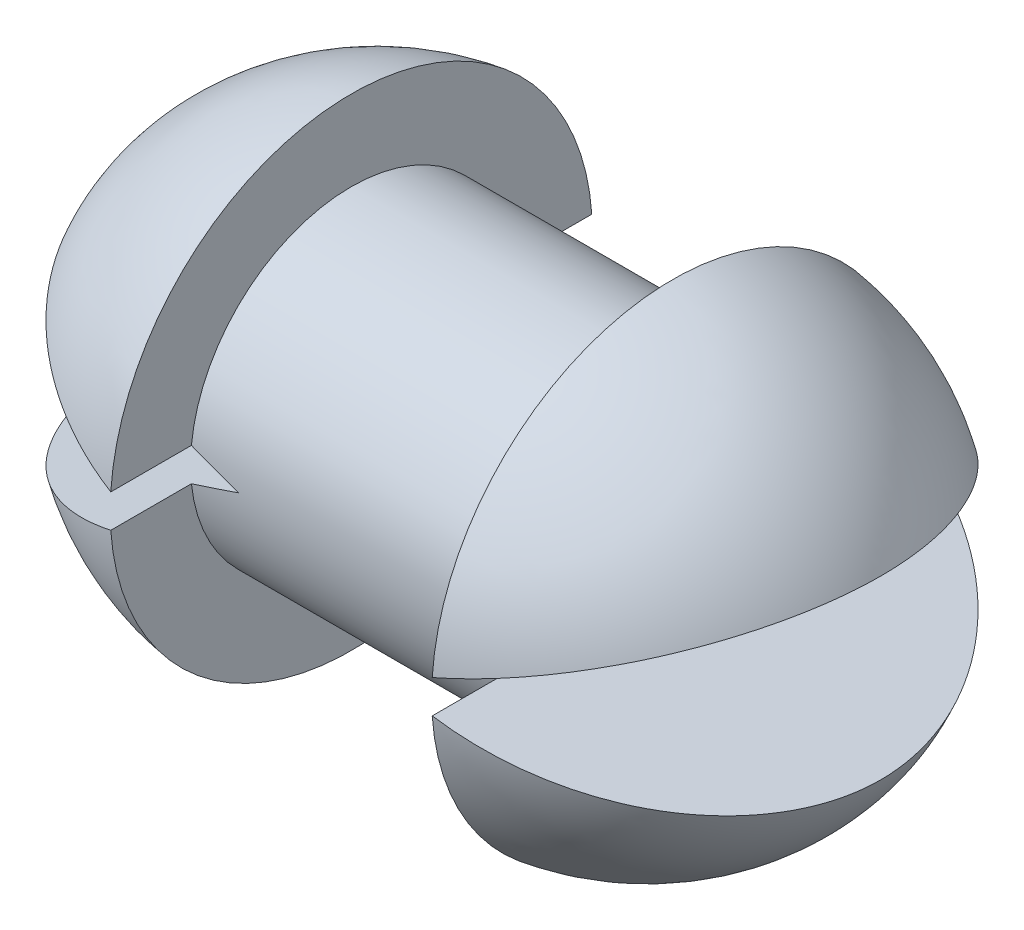
ISO-10303-21;
HEADER;
FILE_DESCRIPTION(('STEP AP214'),'2;1');
FILE_NAME('part.step','',(''),(''),'','','');
FILE_SCHEMA(('AUTOMOTIVE_DESIGN { 1 0 10303 214 1 1 1 1 }'));
ENDSEC;
DATA;
#1=APPLICATION_CONTEXT('core data for automotive mechanical design processes');
#2=APPLICATION_PROTOCOL_DEFINITION('international standard','automotive_design',2000,#1);
#3=PRODUCT_CONTEXT('',#1,'mechanical');
#4=PRODUCT('Part','Part','',(#3));
#5=PRODUCT_RELATED_PRODUCT_CATEGORY('part','',(#4));
#6=PRODUCT_DEFINITION_FORMATION('','',#4);
#7=PRODUCT_DEFINITION_CONTEXT('part definition',#1,'design');
#8=PRODUCT_DEFINITION('design','',#6,#7);
#9=PRODUCT_DEFINITION_SHAPE('','',#8);
#10=(LENGTH_UNIT() NAMED_UNIT(*) SI_UNIT(.MILLI.,.METRE.));
#11=(NAMED_UNIT(*) PLANE_ANGLE_UNIT() SI_UNIT($,.RADIAN.));
#12=(NAMED_UNIT(*) SI_UNIT($,.STERADIAN.) SOLID_ANGLE_UNIT());
#13=UNCERTAINTY_MEASURE_WITH_UNIT(LENGTH_MEASURE(1.E-05),#10,'distance_accuracy_value','');
#14=(GEOMETRIC_REPRESENTATION_CONTEXT(3) GLOBAL_UNCERTAINTY_ASSIGNED_CONTEXT((#13)) GLOBAL_UNIT_ASSIGNED_CONTEXT((#10,
#11,#12)) REPRESENTATION_CONTEXT('',''));
#15=CARTESIAN_POINT('',(0.,0.,0.));
#16=DIRECTION('',(0.,0.,1.));
#17=DIRECTION('',(1.,0.,0.));
#18=AXIS2_PLACEMENT_3D('',#15,#16,#17);
#19=CARTESIAN_POINT('',(-10.,0.,0.));
#20=DIRECTION('',(-1.,0.,0.));
#21=DIRECTION('',(0.,0.,1.));
#22=AXIS2_PLACEMENT_3D('',#19,#20,#21);
#23=PLANE('',#22);
#24=DIRECTION('',(0.,0.,-1.));
#25=VECTOR('',#24,1.);
#26=CARTESIAN_POINT('',(-10.,-1.03298283986898,0.));
#27=LINE('',#26,#25);
#28=CARTESIAN_POINT('',(-10.,-1.03298283986898,14.964389277633));
#29=VERTEX_POINT('',#28);
#30=CARTESIAN_POINT('',(-10.,-1.03298283986898,9.94650423277124));
#31=VERTEX_POINT('',#30);
#32=EDGE_CURVE('E161',#29,#31,#27,.T.);
#33=ORIENTED_EDGE('',*,*,#32,.F.);
#34=CARTESIAN_POINT('',(-10.,0.,0.));
#35=DIRECTION('',(-1.,0.,0.));
#36=DIRECTION('',(0.,0.,1.));
#37=AXIS2_PLACEMENT_3D('',#34,#35,#36);
#38=CIRCLE('',#37,15.);
#39=CARTESIAN_POINT('',(-10.,-1.03298283986898,-14.964389277633));
#40=VERTEX_POINT('',#39);
#41=EDGE_CURVE('E174',#40,#29,#38,.T.);
#42=ORIENTED_EDGE('',*,*,#41,.F.);
#43=CARTESIAN_POINT('',(-10.,-1.03298283986898,-9.94650423277124));
#44=VERTEX_POINT('',#43);
#45=EDGE_CURVE('E156',#44,#40,#27,.T.);
#46=ORIENTED_EDGE('',*,*,#45,.F.);
#47=CARTESIAN_POINT('',(-10.,0.,0.));
#48=DIRECTION('',(-1.,0.,0.));
#49=DIRECTION('',(0.,0.,1.));
#50=AXIS2_PLACEMENT_3D('',#47,#48,#49);
#51=CIRCLE('',#50,10.);
#52=EDGE_CURVE('E152',#44,#31,#51,.T.);
#53=ORIENTED_EDGE('',*,*,#52,.T.);
#54=EDGE_LOOP('',(#33,#42,#46,#53));
#55=FACE_BOUND('',#54,.T.);
#56=ADVANCED_FACE('F35',(#55),#23,.F.);
#57=CARTESIAN_POINT('',(-7.59873592039411,0.,0.));
#58=DIRECTION('',(-1.,0.,0.));
#59=DIRECTION('',(0.,0.,1.));
#60=AXIS2_PLACEMENT_3D('',#57,#58,#59);
#61=DEGENERATE_TOROIDAL_SURFACE('',#60,1.82955527695234,17.,.F.);
#62=CARTESIAN_POINT('',(-9.90106407960589,-0.998916470531055,-14.9805524537835));
#63=CARTESIAN_POINT('',(-10.1208529510761,-1.07459584807203,-14.9453959949566));
#64=CARTESIAN_POINT('',(-10.3399164502651,-1.15002545990665,-14.9053564674339));
#65=CARTESIAN_POINT('',(-10.7762582228299,-1.30026998103246,-14.81557313885));
#66=CARTESIAN_POINT('',(-10.9935364965253,-1.3750848904337,-14.765829339526));
#67=CARTESIAN_POINT('',(-11.6420895482753,-1.59839961483451,-14.6021601314116));
#68=CARTESIAN_POINT('',(-12.0701868901529,-1.74580535081885,-14.4737802147753));
#69=CARTESIAN_POINT('',(-12.9144030373825,-2.03649228189503,-14.1794526945832));
#70=CARTESIAN_POINT('',(-13.3305271305855,-2.17977529773992,-14.013521971126));
#71=CARTESIAN_POINT('',(-14.1480844056182,-2.46128284297954,-13.6451644346249));
#72=CARTESIAN_POINT('',(-14.549517861124,-2.59950746660848,-13.4427383018809));
#73=CARTESIAN_POINT('',(-15.3350697235834,-2.86999466452436,-13.0025904473771));
#74=CARTESIAN_POINT('',(-15.7191753159906,-3.00225282640916,-12.764843144677));
#75=CARTESIAN_POINT('',(-16.4669489171204,-3.25973192576719,-12.2557559554144));
#76=CARTESIAN_POINT('',(-16.8306168383836,-3.38495283312577,-11.9844159251138));
#77=CARTESIAN_POINT('',(-17.53473522331,-3.62740023608084,-11.4100044658669));
#78=CARTESIAN_POINT('',(-17.8751890390481,-3.74462788588928,-11.1069376343049));
#79=CARTESIAN_POINT('',(-18.5302983136767,-3.97020009886607,-10.4710679160666));
#80=CARTESIAN_POINT('',(-18.8449540998171,-4.07854477471556,-10.1382654067014));
#81=CARTESIAN_POINT('',(-19.442614354036,-4.28433570360888,-9.44893920074832));
#82=CARTESIAN_POINT('',(-19.7259275719013,-4.38188826772981,-9.09271502461412));
#83=CARTESIAN_POINT('',(-20.2624960524122,-4.5666436119906,-8.35548863302162));
#84=CARTESIAN_POINT('',(-20.5157367206103,-4.65384136685913,-7.97447452452685));
#85=CARTESIAN_POINT('',(-20.9896337844956,-4.81701721181172,-7.1901229497436));
#86=CARTESIAN_POINT('',(-21.2102739436735,-4.89298971121731,-6.78677449651191));
#87=CARTESIAN_POINT('',(-21.6161754517164,-5.03275280871239,-5.96064803025723));
#88=CARTESIAN_POINT('',(-21.8014411301785,-5.09654489760174,-5.53787240285739));
#89=CARTESIAN_POINT('',(-22.1266184534697,-5.20851242922651,-4.69418876076565));
#90=CARTESIAN_POINT('',(-22.2681286967598,-5.25723831355463,-4.27397157994484));
#91=CARTESIAN_POINT('',(-22.5132045842529,-5.34162470897,-3.42130750625424));
#92=CARTESIAN_POINT('',(-22.6167720698296,-5.37728585409301,-2.9888612079647));
#93=CARTESIAN_POINT('',(-22.7826533798307,-5.43440336965504,-2.11615762108103));
#94=CARTESIAN_POINT('',(-22.8450690361458,-5.45589480362595,-1.67592240251729));
#95=CARTESIAN_POINT('',(-22.9061213680026,-5.47691680733997,-1.01240818970427));
#96=CARTESIAN_POINT('',(-22.9210435505017,-5.48205492682495,-0.790698557485896));
#97=CARTESIAN_POINT('',(-22.9398832185465,-5.48854194475799,-0.34675956816269));
#98=CARTESIAN_POINT('',(-22.9438011187072,-5.48989098596943,-0.124530230954851));
#99=CARTESIAN_POINT('',(-22.9393920308952,-5.48837281528635,0.47858370089827));
#100=CARTESIAN_POINT('',(-22.9203226293297,-5.48180669375843,0.859436650468562));
#101=CARTESIAN_POINT('',(-22.8502935217105,-5.45769373827111,1.61775772541942));
#102=CARTESIAN_POINT('',(-22.7993346321059,-5.44014718543766,1.99522593720662));
#103=CARTESIAN_POINT('',(-22.6670452483703,-5.39459629767243,2.74461481241743));
#104=CARTESIAN_POINT('',(-22.5856787169712,-5.36657955411412,3.11652834670992));
#105=CARTESIAN_POINT('',(-22.3945293694051,-5.30076155548479,3.85199613511567));
#106=CARTESIAN_POINT('',(-22.2847453128474,-5.26295987331304,4.2155500235861));
#107=CARTESIAN_POINT('',(-21.9193109274771,-5.13713072358449,5.27992079472464));
#108=CARTESIAN_POINT('',(-21.6253630838389,-5.03591636415292,5.9663805769457));
#109=CARTESIAN_POINT('',(-20.946982228274,-4.80233110325487,7.28670708928264));
#110=CARTESIAN_POINT('',(-20.5625652907779,-4.66996573665873,7.92058313537912));
#111=CARTESIAN_POINT('',(-19.8939688106769,-4.43974950641166,8.86973810281276));
#112=CARTESIAN_POINT('',(-19.6362823540212,-4.35102094381436,9.20625815546324));
#113=CARTESIAN_POINT('',(-19.0962940440771,-4.16508805784696,9.85657209588034));
#114=CARTESIAN_POINT('',(-18.813990024747,-4.06788298864896,10.170363979393));
#115=CARTESIAN_POINT('',(-18.2267036002958,-3.86566405580027,10.7734618092625));
#116=CARTESIAN_POINT('',(-17.9217120579251,-3.76064704594221,11.0627577886583));
#117=CARTESIAN_POINT('',(-17.2910406473973,-3.54348946438516,11.6152224946425));
#118=CARTESIAN_POINT('',(-16.9653517293905,-3.431345776573,11.8783796614378));
#119=CARTESIAN_POINT('',(-16.274510531077,-3.19347007559554,12.3925462578759));
#120=CARTESIAN_POINT('',(-15.9081641650762,-3.06732690575314,12.6417631658837));
#121=CARTESIAN_POINT('',(-15.1573615862604,-2.8088048457378,13.1071421766497));
#122=CARTESIAN_POINT('',(-14.7729125239912,-2.67642841769517,13.3233171900071));
#123=CARTESIAN_POINT('',(-13.9887173362852,-2.40640836035912,13.7212076794655));
#124=CARTESIAN_POINT('',(-13.5889817556062,-2.26876836191699,13.9029464124683));
#125=CARTESIAN_POINT('',(-12.7768639992798,-1.98913379317095,14.2309151708753));
#126=CARTESIAN_POINT('',(-12.3644871466989,-1.84714105574587,14.3771599171266));
#127=CARTESIAN_POINT('',(-11.6112713614956,-1.58778806213474,14.6082823447669));
#128=CARTESIAN_POINT('',(-11.2721753319549,-1.47102793560698,14.6995662345248));
#129=CARTESIAN_POINT('',(-10.5896522702908,-1.23601639876903,14.8580807525614));
#130=CARTESIAN_POINT('',(-10.2462344197553,-1.11776814993308,14.9253556037912));
#131=CARTESIAN_POINT('',(-9.90106407960589,-0.998916470531055,14.9805524537835));
#132=B_SPLINE_CURVE_WITH_KNOTS('',3,(#62,#63,#64,#65,#66,#67,#68,#69,#70,#71,#72,#73,#74,#75,
#76,#77,#78,#79,#80,#81,#82,#83,#84,#85,#86,#87,#88,#89,#90,#91,#92,#93,#94,#95,#96,#97,#98,#99,
#100,#101,#102,#103,#104,#105,#106,#107,#108,#109,#110,#111,#112,#113,#114,#115,#116,#117,#118,
#119,#120,#121,#122,#123,#124,#125,#126,#127,#128,#129,#130,#131),.UNSPECIFIED.,.F.,.F.,(4,2,2,
2,2,2,2,2,2,2,2,2,2,2,2,2,2,2,2,2,2,2,2,2,2,2,2,2,2,2,2,2,2,2,4),(0.,0.705181687308281,
1.41036324838085,2.82039263765084,4.2297894353893,5.63915996369993,7.04955623326085,
8.45995853789842,9.87015674979894,11.2803370704666,12.6750818468818,14.0705007614729,
15.4666123311864,16.8625529166013,18.1988975077042,19.5351772370051,20.8681377512959,
21.5346856572483,22.2012084489414,23.3437119644191,24.4861862302042,25.6300188024155,
26.7739013099553,29.0255890736481,31.2768770620441,32.5747687624905,33.8727747768297,
35.1713064147053,36.4704097901364,37.8508607581423,39.2307709501858,40.6097458576378,
41.9881478651933,43.0975737608776,44.2049454954057),.UNSPECIFIED.);
#133=EDGE_CURVE('E159',#40,#29,#132,.T.);
#134=ORIENTED_EDGE('',*,*,#133,.F.);
#135=ORIENTED_EDGE('',*,*,#41,.T.);
#136=EDGE_LOOP('',(#134,#135));
#137=FACE_BOUND('',#136,.T.);
#138=ADVANCED_FACE('F183',(#137),#61,.F.);
#139=CARTESIAN_POINT('',(7.59873592039411,0.,0.));
#140=DIRECTION('',(-1.,0.,0.));
#141=DIRECTION('',(0.,0.,1.));
#142=AXIS2_PLACEMENT_3D('',#139,#140,#141);
#143=DEGENERATE_TOROIDAL_SURFACE('',#142,1.82955527695234,17.,.F.);
#144=CARTESIAN_POINT('',(10.,0.,0.));
#145=DIRECTION('',(-1.,0.,0.));
#146=DIRECTION('',(0.,0.,1.));
#147=AXIS2_PLACEMENT_3D('',#144,#145,#146);
#148=CIRCLE('',#147,15.);
#149=CARTESIAN_POINT('',(10.,1.03298283986897,14.964389277633));
#150=VERTEX_POINT('',#149);
#151=CARTESIAN_POINT('',(10.,1.03298283986897,-14.964389277633));
#152=VERTEX_POINT('',#151);
#153=EDGE_CURVE('E171',#150,#152,#148,.T.);
#154=ORIENTED_EDGE('',*,*,#153,.F.);
#155=CARTESIAN_POINT('',(9.90106407960589,0.998916470531052,14.9805524537835));
#156=CARTESIAN_POINT('',(10.1208529510761,1.07459584807203,14.9453959949566));
#157=CARTESIAN_POINT('',(10.3399164502651,1.15002545990665,14.9053564674339));
#158=CARTESIAN_POINT('',(10.7762582228299,1.30026998103246,14.81557313885));
#159=CARTESIAN_POINT('',(10.9935364965253,1.3750848904337,14.765829339526));
#160=CARTESIAN_POINT('',(11.6420895482753,1.59839961483451,14.6021601314116));
#161=CARTESIAN_POINT('',(12.0701868901529,1.74580535081885,14.4737802147753));
#162=CARTESIAN_POINT('',(12.9144030373825,2.03649228189503,14.1794526945832));
#163=CARTESIAN_POINT('',(13.3305271305855,2.17977529773992,14.013521971126));
#164=CARTESIAN_POINT('',(14.1480844056182,2.46128284297954,13.6451644346249));
#165=CARTESIAN_POINT('',(14.549517861124,2.59950746660848,13.4427383018809));
#166=CARTESIAN_POINT('',(15.3350697235834,2.86999466452435,13.0025904473771));
#167=CARTESIAN_POINT('',(15.7191753159906,3.00225282640916,12.764843144677));
#168=CARTESIAN_POINT('',(16.4669489171204,3.25973192576719,12.2557559554144));
#169=CARTESIAN_POINT('',(16.8306168383836,3.38495283312576,11.9844159251138));
#170=CARTESIAN_POINT('',(17.53473522331,3.62740023608083,11.4100044658669));
#171=CARTESIAN_POINT('',(17.8751890390481,3.74462788588928,11.1069376343049));
#172=CARTESIAN_POINT('',(18.5302983136767,3.97020009886606,10.4710679160666));
#173=CARTESIAN_POINT('',(18.8449540998171,4.07854477471556,10.1382654067014));
#174=CARTESIAN_POINT('',(19.442614354036,4.28433570360887,9.44893920074832));
#175=CARTESIAN_POINT('',(19.7259275719013,4.38188826772981,9.09271502461412));
#176=CARTESIAN_POINT('',(20.2624960524122,4.5666436119906,8.35548863302162));
#177=CARTESIAN_POINT('',(20.5157367206103,4.65384136685913,7.97447452452686));
#178=CARTESIAN_POINT('',(20.9896337844956,4.81701721181172,7.1901229497436));
#179=CARTESIAN_POINT('',(21.2102739436735,4.89298971121731,6.78677449651191));
#180=CARTESIAN_POINT('',(21.6161754517164,5.03275280871239,5.96064803025724));
#181=CARTESIAN_POINT('',(21.8014411301785,5.09654489760174,5.53787240285739));
#182=CARTESIAN_POINT('',(22.1266184534697,5.20851242922651,4.69418876076566));
#183=CARTESIAN_POINT('',(22.2681286967598,5.25723831355463,4.27397157994484));
#184=CARTESIAN_POINT('',(22.5132045842529,5.34162470897,3.42130750625425));
#185=CARTESIAN_POINT('',(22.6167720698296,5.37728585409301,2.9888612079647));
#186=CARTESIAN_POINT('',(22.7826533798307,5.43440336965505,2.11615762108104));
#187=CARTESIAN_POINT('',(22.8450690361458,5.45589480362595,1.6759224025173));
#188=CARTESIAN_POINT('',(22.9061213680026,5.47691680733997,1.01240818970427));
#189=CARTESIAN_POINT('',(22.9210435505017,5.48205492682495,0.790698557485901));
#190=CARTESIAN_POINT('',(22.9398832185465,5.48854194475799,0.346759568162694));
#191=CARTESIAN_POINT('',(22.9438011187072,5.48989098596943,0.124530230954854));
#192=CARTESIAN_POINT('',(22.9393920308952,5.48837281528635,-0.478583700898267));
#193=CARTESIAN_POINT('',(22.9203226293297,5.48180669375843,-0.859436650468558));
#194=CARTESIAN_POINT('',(22.8502935217105,5.45769373827111,-1.61775772541942));
#195=CARTESIAN_POINT('',(22.7993346321059,5.44014718543766,-1.99522593720661));
#196=CARTESIAN_POINT('',(22.6670452483703,5.39459629767243,-2.74461481241743));
#197=CARTESIAN_POINT('',(22.5856787169712,5.36657955411413,-3.11652834670992));
#198=CARTESIAN_POINT('',(22.3945293694051,5.3007615554848,-3.85199613511567));
#199=CARTESIAN_POINT('',(22.2847453128474,5.26295987331305,-4.2155500235861));
#200=CARTESIAN_POINT('',(21.9193109274771,5.13713072358449,-5.27992079472464));
#201=CARTESIAN_POINT('',(21.6253630838389,5.03591636415292,-5.96638057694569));
#202=CARTESIAN_POINT('',(20.946982228274,4.80233110325487,-7.28670708928264));
#203=CARTESIAN_POINT('',(20.562565290778,4.66996573665873,-7.92058313537911));
#204=CARTESIAN_POINT('',(19.8939688106769,4.43974950641166,-8.86973810281276));
#205=CARTESIAN_POINT('',(19.6362823540212,4.35102094381436,-9.20625815546324));
#206=CARTESIAN_POINT('',(19.0962940440771,4.16508805784696,-9.85657209588034));
#207=CARTESIAN_POINT('',(18.813990024747,4.06788298864896,-10.170363979393));
#208=CARTESIAN_POINT('',(18.2267036002958,3.86566405580027,-10.7734618092625));
#209=CARTESIAN_POINT('',(17.9217120579251,3.76064704594222,-11.0627577886583));
#210=CARTESIAN_POINT('',(17.2910406473973,3.54348946438516,-11.6152224946425));
#211=CARTESIAN_POINT('',(16.9653517293905,3.431345776573,-11.8783796614378));
#212=CARTESIAN_POINT('',(16.274510531077,3.19347007559554,-12.3925462578759));
#213=CARTESIAN_POINT('',(15.9081641650762,3.06732690575314,-12.6417631658837));
#214=CARTESIAN_POINT('',(15.1573615862604,2.8088048457378,-13.1071421766497));
#215=CARTESIAN_POINT('',(14.7729125239912,2.67642841769517,-13.3233171900071));
#216=CARTESIAN_POINT('',(13.9887173362852,2.40640836035912,-13.7212076794655));
#217=CARTESIAN_POINT('',(13.5889817556062,2.26876836191698,-13.9029464124683));
#218=CARTESIAN_POINT('',(12.7768639992797,1.98913379317094,-14.2309151708753));
#219=CARTESIAN_POINT('',(12.3644871466989,1.84714105574587,-14.3771599171266));
#220=CARTESIAN_POINT('',(11.6112713614956,1.58778806213474,-14.6082823447669));
#221=CARTESIAN_POINT('',(11.2721753319549,1.47102793560697,-14.6995662345248));
#222=CARTESIAN_POINT('',(10.5896522702908,1.23601639876903,-14.8580807525614));
#223=CARTESIAN_POINT('',(10.2462344197553,1.11776814993308,-14.9253556037912));
#224=CARTESIAN_POINT('',(9.90106407960589,0.998916470531052,-14.9805524537835));
#225=B_SPLINE_CURVE_WITH_KNOTS('',3,(#155,#156,#157,#158,#159,#160,#161,#162,#163,#164,#165,
#166,#167,#168,#169,#170,#171,#172,#173,#174,#175,#176,#177,#178,#179,#180,#181,#182,#183,#184,
#185,#186,#187,#188,#189,#190,#191,#192,#193,#194,#195,#196,#197,#198,#199,#200,#201,#202,#203,
#204,#205,#206,#207,#208,#209,#210,#211,#212,#213,#214,#215,#216,#217,#218,#219,#220,#221,#222,
#223,#224),.UNSPECIFIED.,.F.,.F.,(4,2,2,2,2,2,2,2,2,2,2,2,2,2,2,2,2,2,2,2,2,2,2,2,2,2,2,2,2,2,2,
2,2,2,4),(0.,0.70518168730828,1.41036324838085,2.82039263765085,4.2297894353893,
5.63915996369992,7.04955623326085,8.45995853789841,9.87015674979894,11.2803370704666,
12.6750818468818,14.0705007614729,15.4666123311864,16.8625529166013,18.1988975077042,
19.5351772370051,20.8681377512959,21.5346856572483,22.2012084489414,23.3437119644191,
24.4861862302042,25.6300188024155,26.7739013099553,29.0255890736481,31.2768770620441,
32.5747687624905,33.8727747768297,35.1713064147053,36.4704097901364,37.8508607581423,
39.2307709501858,40.6097458576378,41.9881478651933,43.0975737608776,44.2049454954057),.UNSPECIFIED.);
#226=EDGE_CURVE('E225',#150,#152,#225,.T.);
#227=ORIENTED_EDGE('',*,*,#226,.T.);
#228=EDGE_LOOP('',(#154,#227));
#229=FACE_BOUND('',#228,.T.);
#230=ADVANCED_FACE('F223',(#229),#143,.F.);
#231=CARTESIAN_POINT('',(10.,0.,0.));
#232=DIRECTION('',(-1.,0.,0.));
#233=DIRECTION('',(0.,0.,1.));
#234=AXIS2_PLACEMENT_3D('',#231,#232,#233);
#235=PLANE('',#234);
#236=ORIENTED_EDGE('',*,*,#153,.T.);
#237=DIRECTION('',(0.,0.,1.));
#238=VECTOR('',#237,1.);
#239=CARTESIAN_POINT('',(10.,1.03298283986897,0.));
#240=LINE('',#239,#238);
#241=CARTESIAN_POINT('',(10.,1.03298283986897,-9.94650423277124));
#242=VERTEX_POINT('',#241);
#243=EDGE_CURVE('E216',#152,#242,#240,.T.);
#244=ORIENTED_EDGE('',*,*,#243,.T.);
#245=CARTESIAN_POINT('',(10.,0.,0.));
#246=DIRECTION('',(-1.,0.,0.));
#247=DIRECTION('',(0.,0.,1.));
#248=AXIS2_PLACEMENT_3D('',#245,#246,#247);
#249=CIRCLE('',#248,10.);
#250=CARTESIAN_POINT('',(10.,1.03298283986897,9.94650423277124));
#251=VERTEX_POINT('',#250);
#252=EDGE_CURVE('E134',#251,#242,#249,.T.);
#253=ORIENTED_EDGE('',*,*,#252,.F.);
#254=EDGE_CURVE('E231',#251,#150,#240,.T.);
#255=ORIENTED_EDGE('',*,*,#254,.T.);
#256=EDGE_LOOP('',(#236,#244,#253,#255));
#257=FACE_BOUND('',#256,.T.);
#258=ADVANCED_FACE('F242',(#257),#235,.T.);
#259=CARTESIAN_POINT('',(-3.12249899919919,0.,0.));
#260=DIRECTION('',(-1.,0.,0.));
#261=DIRECTION('',(0.,0.,1.));
#262=AXIS2_PLACEMENT_3D('',#259,#260,#261);
#263=CYLINDRICAL_SURFACE('',#262,10.);
#264=CARTESIAN_POINT('',(7.,0.,0.));
#265=DIRECTION('',(-0.325568154457151,-0.945518575599319,0.));
#266=DIRECTION('',(-0.945518575599319,0.325568154457151,0.));
#267=AXIS2_PLACEMENT_3D('',#264,#265,#266);
#268=ELLIPSE('',#267,30.715534867573,10.);
#269=CARTESIAN_POINT('',(7.,0.,9.99999999999999));
#270=VERTEX_POINT('',#269);
#271=CARTESIAN_POINT('',(10.,-1.03298283986898,9.94650423277124));
#272=VERTEX_POINT('',#271);
#273=EDGE_CURVE('E123',#270,#272,#268,.F.);
#274=ORIENTED_EDGE('',*,*,#273,.F.);
#275=CARTESIAN_POINT('',(7.00000000000001,0.,0.));
#276=DIRECTION('',(0.325568154457151,-0.945518575599319,0.));
#277=DIRECTION('',(-0.945518575599319,-0.325568154457151,0.));
#278=AXIS2_PLACEMENT_3D('',#275,#276,#277);
#279=ELLIPSE('',#278,30.715534867573,10.);
#280=EDGE_CURVE('E128',#270,#251,#279,.F.);
#281=ORIENTED_EDGE('',*,*,#280,.T.);
#282=ORIENTED_EDGE('',*,*,#252,.T.);
#283=CARTESIAN_POINT('',(7.,0.,-10.));
#284=VERTEX_POINT('',#283);
#285=EDGE_CURVE('E120',#242,#284,#279,.F.);
#286=ORIENTED_EDGE('',*,*,#285,.T.);
#287=CARTESIAN_POINT('',(10.,-1.03298283986898,-9.94650423277124));
#288=VERTEX_POINT('',#287);
#289=EDGE_CURVE('E111',#288,#284,#268,.F.);
#290=ORIENTED_EDGE('',*,*,#289,.F.);
#291=EDGE_CURVE('E158',#288,#272,#249,.T.);
#292=ORIENTED_EDGE('',*,*,#291,.T.);
#293=EDGE_LOOP('',(#274,#281,#282,#286,#290,#292));
#294=FACE_BOUND('',#293,.T.);
#295=ORIENTED_EDGE('',*,*,#52,.F.);
#296=CARTESIAN_POINT('',(-6.99999999999999,0.,0.));
#297=DIRECTION('',(-0.325568154457151,0.945518575599319,0.));
#298=DIRECTION('',(-0.945518575599319,-0.325568154457151,0.));
#299=AXIS2_PLACEMENT_3D('',#296,#297,#298);
#300=ELLIPSE('',#299,30.715534867573,10.);
#301=CARTESIAN_POINT('',(-7.,0.,-10.));
#302=VERTEX_POINT('',#301);
#303=EDGE_CURVE('E11',#44,#302,#300,.F.);
#304=ORIENTED_EDGE('',*,*,#303,.T.);
#305=CARTESIAN_POINT('',(-7.00000000000001,0.,0.));
#306=DIRECTION('',(0.325568154457151,0.945518575599319,0.));
#307=DIRECTION('',(-0.945518575599319,0.325568154457151,0.));
#308=AXIS2_PLACEMENT_3D('',#305,#306,#307);
#309=ELLIPSE('',#308,30.715534867573,10.);
#310=CARTESIAN_POINT('',(-10.,1.03298283986897,-9.94650423277124));
#311=VERTEX_POINT('',#310);
#312=EDGE_CURVE('E44',#311,#302,#309,.F.);
#313=ORIENTED_EDGE('',*,*,#312,.F.);
#314=CARTESIAN_POINT('',(-10.,1.03298283986897,9.94650423277124));
#315=VERTEX_POINT('',#314);
#316=EDGE_CURVE('E155',#315,#311,#51,.T.);
#317=ORIENTED_EDGE('',*,*,#316,.F.);
#318=CARTESIAN_POINT('',(-7.,0.,10.));
#319=VERTEX_POINT('',#318);
#320=EDGE_CURVE('E136',#319,#315,#309,.F.);
#321=ORIENTED_EDGE('',*,*,#320,.F.);
#322=EDGE_CURVE('E39',#319,#31,#300,.F.);
#323=ORIENTED_EDGE('',*,*,#322,.T.);
#324=EDGE_LOOP('',(#295,#304,#313,#317,#321,#323));
#325=FACE_BOUND('',#324,.T.);
#326=ADVANCED_FACE('F131',(#294,#325),#263,.T.);
#327=CARTESIAN_POINT('',(-10.,1.03298283986897,14.964389277633));
#328=VERTEX_POINT('',#327);
#329=CARTESIAN_POINT('',(-10.,1.03298283986897,-14.964389277633));
#330=VERTEX_POINT('',#329);
#331=EDGE_CURVE('E121',#328,#330,#38,.T.);
#332=ORIENTED_EDGE('',*,*,#331,.F.);
#333=DIRECTION('',(0.,0.,-1.));
#334=VECTOR('',#333,1.);
#335=CARTESIAN_POINT('',(-10.,1.03298283986897,0.));
#336=LINE('',#335,#334);
#337=EDGE_CURVE('E186',#328,#315,#336,.T.);
#338=ORIENTED_EDGE('',*,*,#337,.T.);
#339=ORIENTED_EDGE('',*,*,#316,.T.);
#340=EDGE_CURVE('E143',#311,#330,#336,.T.);
#341=ORIENTED_EDGE('',*,*,#340,.T.);
#342=EDGE_LOOP('',(#332,#338,#339,#341));
#343=FACE_BOUND('',#342,.T.);
#344=ADVANCED_FACE('F37',(#343),#23,.F.);
#345=ORIENTED_EDGE('',*,*,#331,.T.);
#346=CARTESIAN_POINT('',(-9.90106407960589,0.998916470531052,-14.9805524537835));
#347=CARTESIAN_POINT('',(-10.1208529510761,1.07459584807203,-14.9453959949566));
#348=CARTESIAN_POINT('',(-10.3399164502651,1.15002545990665,-14.9053564674339));
#349=CARTESIAN_POINT('',(-10.7762582228299,1.30026998103246,-14.81557313885));
#350=CARTESIAN_POINT('',(-10.9935364965253,1.3750848904337,-14.765829339526));
#351=CARTESIAN_POINT('',(-11.6420895482753,1.59839961483451,-14.6021601314116));
#352=CARTESIAN_POINT('',(-12.0701868901529,1.74580535081885,-14.4737802147753));
#353=CARTESIAN_POINT('',(-12.9144030373825,2.03649228189503,-14.1794526945832));
#354=CARTESIAN_POINT('',(-13.3305271305855,2.17977529773992,-14.013521971126));
#355=CARTESIAN_POINT('',(-14.1480844056182,2.46128284297954,-13.6451644346249));
#356=CARTESIAN_POINT('',(-14.549517861124,2.59950746660848,-13.4427383018809));
#357=CARTESIAN_POINT('',(-15.3350697235834,2.86999466452435,-13.0025904473771));
#358=CARTESIAN_POINT('',(-15.7191753159906,3.00225282640916,-12.764843144677));
#359=CARTESIAN_POINT('',(-16.4669489171204,3.25973192576719,-12.2557559554144));
#360=CARTESIAN_POINT('',(-16.8306168383836,3.38495283312576,-11.9844159251138));
#361=CARTESIAN_POINT('',(-17.53473522331,3.62740023608083,-11.4100044658669));
#362=CARTESIAN_POINT('',(-17.8751890390481,3.74462788588928,-11.1069376343049));
#363=CARTESIAN_POINT('',(-18.5302983136767,3.97020009886606,-10.4710679160666));
#364=CARTESIAN_POINT('',(-18.8449540998171,4.07854477471556,-10.1382654067014));
#365=CARTESIAN_POINT('',(-19.442614354036,4.28433570360887,-9.44893920074832));
#366=CARTESIAN_POINT('',(-19.7259275719013,4.38188826772981,-9.09271502461412));
#367=CARTESIAN_POINT('',(-20.2624960524122,4.5666436119906,-8.35548863302162));
#368=CARTESIAN_POINT('',(-20.5157367206103,4.65384136685913,-7.97447452452686));
#369=CARTESIAN_POINT('',(-20.9896337844956,4.81701721181172,-7.1901229497436));
#370=CARTESIAN_POINT('',(-21.2102739436735,4.89298971121731,-6.78677449651191));
#371=CARTESIAN_POINT('',(-21.6161754517164,5.03275280871239,-5.96064803025724));
#372=CARTESIAN_POINT('',(-21.8014411301785,5.09654489760174,-5.53787240285739));
#373=CARTESIAN_POINT('',(-22.1266184534697,5.20851242922651,-4.69418876076566));
#374=CARTESIAN_POINT('',(-22.2681286967598,5.25723831355463,-4.27397157994484));
#375=CARTESIAN_POINT('',(-22.5132045842529,5.34162470897,-3.42130750625425));
#376=CARTESIAN_POINT('',(-22.6167720698296,5.37728585409301,-2.9888612079647));
#377=CARTESIAN_POINT('',(-22.7826533798307,5.43440336965505,-2.11615762108104));
#378=CARTESIAN_POINT('',(-22.8450690361458,5.45589480362595,-1.6759224025173));
#379=CARTESIAN_POINT('',(-22.9061213680026,5.47691680733997,-1.01240818970427));
#380=CARTESIAN_POINT('',(-22.9210435505017,5.48205492682495,-0.790698557485901));
#381=CARTESIAN_POINT('',(-22.9398832185465,5.48854194475799,-0.346759568162694));
#382=CARTESIAN_POINT('',(-22.9438011187072,5.48989098596943,-0.124530230954854));
#383=CARTESIAN_POINT('',(-22.9393920308952,5.48837281528635,0.478583700898267));
#384=CARTESIAN_POINT('',(-22.9203226293297,5.48180669375843,0.859436650468558));
#385=CARTESIAN_POINT('',(-22.8502935217105,5.45769373827111,1.61775772541942));
#386=CARTESIAN_POINT('',(-22.7993346321059,5.44014718543766,1.99522593720661));
#387=CARTESIAN_POINT('',(-22.6670452483703,5.39459629767243,2.74461481241743));
#388=CARTESIAN_POINT('',(-22.5856787169712,5.36657955411413,3.11652834670992));
#389=CARTESIAN_POINT('',(-22.3945293694051,5.3007615554848,3.85199613511567));
#390=CARTESIAN_POINT('',(-22.2847453128474,5.26295987331305,4.2155500235861));
#391=CARTESIAN_POINT('',(-21.9193109274771,5.13713072358449,5.27992079472464));
#392=CARTESIAN_POINT('',(-21.6253630838389,5.03591636415292,5.96638057694569));
#393=CARTESIAN_POINT('',(-20.946982228274,4.80233110325487,7.28670708928264));
#394=CARTESIAN_POINT('',(-20.562565290778,4.66996573665873,7.92058313537911));
#395=CARTESIAN_POINT('',(-19.8939688106769,4.43974950641166,8.86973810281276));
#396=CARTESIAN_POINT('',(-19.6362823540212,4.35102094381436,9.20625815546324));
#397=CARTESIAN_POINT('',(-19.0962940440771,4.16508805784696,9.85657209588034));
#398=CARTESIAN_POINT('',(-18.813990024747,4.06788298864896,10.170363979393));
#399=CARTESIAN_POINT('',(-18.2267036002958,3.86566405580027,10.7734618092625));
#400=CARTESIAN_POINT('',(-17.9217120579251,3.76064704594222,11.0627577886583));
#401=CARTESIAN_POINT('',(-17.2910406473973,3.54348946438516,11.6152224946425));
#402=CARTESIAN_POINT('',(-16.9653517293905,3.431345776573,11.8783796614378));
#403=CARTESIAN_POINT('',(-16.274510531077,3.19347007559554,12.3925462578759));
#404=CARTESIAN_POINT('',(-15.9081641650762,3.06732690575314,12.6417631658837));
#405=CARTESIAN_POINT('',(-15.1573615862604,2.8088048457378,13.1071421766497));
#406=CARTESIAN_POINT('',(-14.7729125239912,2.67642841769517,13.3233171900071));
#407=CARTESIAN_POINT('',(-13.9887173362852,2.40640836035912,13.7212076794655));
#408=CARTESIAN_POINT('',(-13.5889817556062,2.26876836191698,13.9029464124683));
#409=CARTESIAN_POINT('',(-12.7768639992797,1.98913379317094,14.2309151708753));
#410=CARTESIAN_POINT('',(-12.3644871466989,1.84714105574587,14.3771599171266));
#411=CARTESIAN_POINT('',(-11.6112713614956,1.58778806213474,14.6082823447669));
#412=CARTESIAN_POINT('',(-11.2721753319549,1.47102793560697,14.6995662345248));
#413=CARTESIAN_POINT('',(-10.5896522702908,1.23601639876903,14.8580807525614));
#414=CARTESIAN_POINT('',(-10.2462344197553,1.11776814993308,14.9253556037912));
#415=CARTESIAN_POINT('',(-9.90106407960589,0.998916470531052,14.9805524537835));
#416=B_SPLINE_CURVE_WITH_KNOTS('',3,(#346,#347,#348,#349,#350,#351,#352,#353,#354,#355,#356,
#357,#358,#359,#360,#361,#362,#363,#364,#365,#366,#367,#368,#369,#370,#371,#372,#373,#374,#375,
#376,#377,#378,#379,#380,#381,#382,#383,#384,#385,#386,#387,#388,#389,#390,#391,#392,#393,#394,
#395,#396,#397,#398,#399,#400,#401,#402,#403,#404,#405,#406,#407,#408,#409,#410,#411,#412,#413,
#414,#415),.UNSPECIFIED.,.F.,.F.,(4,2,2,2,2,2,2,2,2,2,2,2,2,2,2,2,2,2,2,2,2,2,2,2,2,2,2,2,2,2,2,
2,2,2,4),(0.,0.70518168730828,1.41036324838085,2.82039263765085,4.2297894353893,
5.63915996369992,7.04955623326085,8.45995853789841,9.87015674979894,11.2803370704666,
12.6750818468818,14.0705007614729,15.4666123311864,16.8625529166013,18.1988975077042,
19.5351772370051,20.8681377512959,21.5346856572483,22.2012084489414,23.3437119644191,
24.4861862302042,25.6300188024155,26.7739013099553,29.0255890736481,31.2768770620441,
32.5747687624905,33.8727747768297,35.1713064147053,36.4704097901364,37.8508607581423,
39.2307709501858,40.6097458576378,41.9881478651933,43.0975737608776,44.2049454954057),.UNSPECIFIED.);
#417=EDGE_CURVE('E184',#330,#328,#416,.T.);
#418=ORIENTED_EDGE('',*,*,#417,.T.);
#419=EDGE_LOOP('',(#345,#418));
#420=FACE_BOUND('',#419,.T.);
#421=ADVANCED_FACE('F194',(#420),#61,.F.);
#422=CARTESIAN_POINT('',(9.90106407960589,-0.998916470531055,14.9805524537835));
#423=CARTESIAN_POINT('',(10.1208529510761,-1.07459584807203,14.9453959949566));
#424=CARTESIAN_POINT('',(10.3399164502651,-1.15002545990665,14.9053564674339));
#425=CARTESIAN_POINT('',(10.7762582228299,-1.30026998103246,14.81557313885));
#426=CARTESIAN_POINT('',(10.9935364965253,-1.3750848904337,14.765829339526));
#427=CARTESIAN_POINT('',(11.6420895482753,-1.59839961483451,14.6021601314116));
#428=CARTESIAN_POINT('',(12.0701868901529,-1.74580535081885,14.4737802147753));
#429=CARTESIAN_POINT('',(12.9144030373825,-2.03649228189503,14.1794526945832));
#430=CARTESIAN_POINT('',(13.3305271305855,-2.17977529773992,14.013521971126));
#431=CARTESIAN_POINT('',(14.1480844056182,-2.46128284297954,13.6451644346249));
#432=CARTESIAN_POINT('',(14.549517861124,-2.59950746660848,13.4427383018809));
#433=CARTESIAN_POINT('',(15.3350697235834,-2.86999466452436,13.0025904473771));
#434=CARTESIAN_POINT('',(15.7191753159906,-3.00225282640916,12.764843144677));
#435=CARTESIAN_POINT('',(16.4669489171204,-3.25973192576719,12.2557559554144));
#436=CARTESIAN_POINT('',(16.8306168383836,-3.38495283312576,11.9844159251138));
#437=CARTESIAN_POINT('',(17.53473522331,-3.62740023608084,11.4100044658669));
#438=CARTESIAN_POINT('',(17.8751890390481,-3.74462788588928,11.1069376343049));
#439=CARTESIAN_POINT('',(18.5302983136767,-3.97020009886607,10.4710679160666));
#440=CARTESIAN_POINT('',(18.8449540998171,-4.07854477471556,10.1382654067014));
#441=CARTESIAN_POINT('',(19.442614354036,-4.28433570360887,9.44893920074832));
#442=CARTESIAN_POINT('',(19.7259275719013,-4.38188826772981,9.09271502461412));
#443=CARTESIAN_POINT('',(20.2624960524122,-4.5666436119906,8.35548863302162));
#444=CARTESIAN_POINT('',(20.5157367206103,-4.65384136685913,7.97447452452685));
#445=CARTESIAN_POINT('',(20.9896337844956,-4.81701721181172,7.1901229497436));
#446=CARTESIAN_POINT('',(21.2102739436735,-4.89298971121731,6.78677449651191));
#447=CARTESIAN_POINT('',(21.6161754517164,-5.03275280871239,5.96064803025724));
#448=CARTESIAN_POINT('',(21.8014411301785,-5.09654489760174,5.53787240285739));
#449=CARTESIAN_POINT('',(22.1266184534697,-5.20851242922651,4.69418876076565));
#450=CARTESIAN_POINT('',(22.2681286967598,-5.25723831355463,4.27397157994484));
#451=CARTESIAN_POINT('',(22.5132045842529,-5.34162470897,3.42130750625425));
#452=CARTESIAN_POINT('',(22.6167720698296,-5.37728585409301,2.9888612079647));
#453=CARTESIAN_POINT('',(22.7826533798307,-5.43440336965504,2.11615762108104));
#454=CARTESIAN_POINT('',(22.8450690361458,-5.45589480362595,1.6759224025173));
#455=CARTESIAN_POINT('',(22.9061213680026,-5.47691680733997,1.01240818970427));
#456=CARTESIAN_POINT('',(22.9210435505017,-5.48205492682495,0.790698557485898));
#457=CARTESIAN_POINT('',(22.9398832185465,-5.48854194475799,0.346759568162693));
#458=CARTESIAN_POINT('',(22.9438011187072,-5.48989098596943,0.124530230954854));
#459=CARTESIAN_POINT('',(22.9393920308952,-5.48837281528635,-0.478583700898268));
#460=CARTESIAN_POINT('',(22.9203226293297,-5.48180669375843,-0.85943665046856));
#461=CARTESIAN_POINT('',(22.8502935217105,-5.45769373827111,-1.61775772541942));
#462=CARTESIAN_POINT('',(22.7993346321059,-5.44014718543766,-1.99522593720661));
#463=CARTESIAN_POINT('',(22.6670452483703,-5.39459629767243,-2.74461481241743));
#464=CARTESIAN_POINT('',(22.5856787169712,-5.36657955411413,-3.11652834670992));
#465=CARTESIAN_POINT('',(22.3945293694051,-5.3007615554848,-3.85199613511567));
#466=CARTESIAN_POINT('',(22.2847453128474,-5.26295987331305,-4.2155500235861));
#467=CARTESIAN_POINT('',(21.9193109274771,-5.13713072358449,-5.27992079472464));
#468=CARTESIAN_POINT('',(21.6253630838389,-5.03591636415292,-5.96638057694569));
#469=CARTESIAN_POINT('',(20.946982228274,-4.80233110325487,-7.28670708928264));
#470=CARTESIAN_POINT('',(20.5625652907779,-4.66996573665873,-7.92058313537912));
#471=CARTESIAN_POINT('',(19.8939688106769,-4.43974950641166,-8.86973810281276));
#472=CARTESIAN_POINT('',(19.6362823540212,-4.35102094381436,-9.20625815546324));
#473=CARTESIAN_POINT('',(19.0962940440771,-4.16508805784696,-9.85657209588034));
#474=CARTESIAN_POINT('',(18.813990024747,-4.06788298864896,-10.170363979393));
#475=CARTESIAN_POINT('',(18.2267036002958,-3.86566405580027,-10.7734618092625));
#476=CARTESIAN_POINT('',(17.9217120579251,-3.76064704594222,-11.0627577886583));
#477=CARTESIAN_POINT('',(17.2910406473973,-3.54348946438517,-11.6152224946425));
#478=CARTESIAN_POINT('',(16.9653517293905,-3.431345776573,-11.8783796614378));
#479=CARTESIAN_POINT('',(16.274510531077,-3.19347007559554,-12.3925462578759));
#480=CARTESIAN_POINT('',(15.9081641650762,-3.06732690575314,-12.6417631658837));
#481=CARTESIAN_POINT('',(15.1573615862604,-2.8088048457378,-13.1071421766497));
#482=CARTESIAN_POINT('',(14.7729125239912,-2.67642841769517,-13.3233171900071));
#483=CARTESIAN_POINT('',(13.9887173362852,-2.40640836035912,-13.7212076794655));
#484=CARTESIAN_POINT('',(13.5889817556062,-2.26876836191698,-13.9029464124683));
#485=CARTESIAN_POINT('',(12.7768639992798,-1.98913379317095,-14.2309151708753));
#486=CARTESIAN_POINT('',(12.3644871466989,-1.84714105574588,-14.3771599171266));
#487=CARTESIAN_POINT('',(11.6112713614956,-1.58778806213474,-14.6082823447669));
#488=CARTESIAN_POINT('',(11.2721753319549,-1.47102793560698,-14.6995662345248));
#489=CARTESIAN_POINT('',(10.5896522702908,-1.23601639876903,-14.8580807525614));
#490=CARTESIAN_POINT('',(10.2462344197553,-1.11776814993308,-14.9253556037912));
#491=CARTESIAN_POINT('',(9.90106407960589,-0.998916470531055,-14.9805524537835));
#492=B_SPLINE_CURVE_WITH_KNOTS('',3,(#422,#423,#424,#425,#426,#427,#428,#429,#430,#431,#432,
#433,#434,#435,#436,#437,#438,#439,#440,#441,#442,#443,#444,#445,#446,#447,#448,#449,#450,#451,
#452,#453,#454,#455,#456,#457,#458,#459,#460,#461,#462,#463,#464,#465,#466,#467,#468,#469,#470,
#471,#472,#473,#474,#475,#476,#477,#478,#479,#480,#481,#482,#483,#484,#485,#486,#487,#488,#489,
#490,#491),.UNSPECIFIED.,.F.,.F.,(4,2,2,2,2,2,2,2,2,2,2,2,2,2,2,2,2,2,2,2,2,2,2,2,2,2,2,2,2,2,2,
2,2,2,4),(0.,0.705181687308281,1.41036324838085,2.82039263765084,4.2297894353893,
5.63915996369992,7.04955623326085,8.45995853789842,9.87015674979894,11.2803370704666,
12.6750818468818,14.0705007614729,15.4666123311864,16.8625529166013,18.1988975077042,
19.5351772370051,20.8681377512958,21.5346856572483,22.2012084489414,23.343711964419,
24.4861862302042,25.6300188024155,26.7739013099553,29.0255890736481,31.2768770620441,
32.5747687624905,33.8727747768297,35.1713064147053,36.4704097901364,37.8508607581423,
39.2307709501858,40.6097458576378,41.9881478651933,43.0975737608776,44.2049454954057),.UNSPECIFIED.);
#493=CARTESIAN_POINT('',(10.,-1.03298283986898,14.964389277633));
#494=VERTEX_POINT('',#493);
#495=CARTESIAN_POINT('',(10.,-1.03298283986898,-14.964389277633));
#496=VERTEX_POINT('',#495);
#497=EDGE_CURVE('E208',#494,#496,#492,.T.);
#498=ORIENTED_EDGE('',*,*,#497,.F.);
#499=EDGE_CURVE('E170',#496,#494,#148,.T.);
#500=ORIENTED_EDGE('',*,*,#499,.F.);
#501=EDGE_LOOP('',(#498,#500));
#502=FACE_BOUND('',#501,.T.);
#503=ADVANCED_FACE('F217',(#502),#143,.F.);
#504=DIRECTION('',(0.,0.,1.));
#505=VECTOR('',#504,1.);
#506=CARTESIAN_POINT('',(10.,-1.03298283986898,0.));
#507=LINE('',#506,#505);
#508=EDGE_CURVE('E59',#496,#288,#507,.T.);
#509=ORIENTED_EDGE('',*,*,#508,.F.);
#510=ORIENTED_EDGE('',*,*,#499,.T.);
#511=EDGE_CURVE('E215',#272,#494,#507,.T.);
#512=ORIENTED_EDGE('',*,*,#511,.F.);
#513=ORIENTED_EDGE('',*,*,#291,.F.);
#514=EDGE_LOOP('',(#509,#510,#512,#513));
#515=FACE_BOUND('',#514,.T.);
#516=ADVANCED_FACE('F221',(#515),#235,.T.);
#517=CARTESIAN_POINT('',(0.741962362376447,-2.15481516363977,-20.));
#518=DIRECTION('',(0.325568154457151,-0.945518575599319,0.));
#519=DIRECTION('',(0.945518575599319,0.325568154457151,0.));
#520=AXIS2_PLACEMENT_3D('',#517,#518,#519);
#521=PLANE('',#520);
#522=DIRECTION('',(0.,0.,1.));
#523=VECTOR('',#522,1.);
#524=CARTESIAN_POINT('',(7.,0.,-20.));
#525=LINE('',#524,#523);
#526=EDGE_CURVE('E114',#284,#270,#525,.T.);
#527=ORIENTED_EDGE('',*,*,#526,.F.);
#528=ORIENTED_EDGE('',*,*,#285,.F.);
#529=ORIENTED_EDGE('',*,*,#243,.F.);
#530=ORIENTED_EDGE('',*,*,#226,.F.);
#531=ORIENTED_EDGE('',*,*,#254,.F.);
#532=ORIENTED_EDGE('',*,*,#280,.F.);
#533=EDGE_LOOP('',(#527,#528,#529,#530,#531,#532));
#534=FACE_BOUND('',#533,.T.);
#535=ADVANCED_FACE('F125',(#534),#521,.T.);
#536=CARTESIAN_POINT('',(0.741962362376445,2.15481516363977,-20.));
#537=DIRECTION('',(-0.325568154457151,-0.945518575599319,0.));
#538=DIRECTION('',(0.945518575599319,-0.325568154457151,0.));
#539=AXIS2_PLACEMENT_3D('',#536,#537,#538);
#540=PLANE('',#539);
#541=ORIENTED_EDGE('',*,*,#273,.T.);
#542=ORIENTED_EDGE('',*,*,#511,.T.);
#543=ORIENTED_EDGE('',*,*,#497,.T.);
#544=ORIENTED_EDGE('',*,*,#508,.T.);
#545=ORIENTED_EDGE('',*,*,#289,.T.);
#546=ORIENTED_EDGE('',*,*,#526,.T.);
#547=EDGE_LOOP('',(#541,#542,#543,#544,#545,#546));
#548=FACE_BOUND('',#547,.T.);
#549=ADVANCED_FACE('F113',(#548),#540,.F.);
#550=CARTESIAN_POINT('',(-0.741962362376445,2.15481516363977,-20.));
#551=DIRECTION('',(-0.325568154457151,0.945518575599319,0.));
#552=DIRECTION('',(-0.945518575599319,-0.325568154457151,0.));
#553=AXIS2_PLACEMENT_3D('',#550,#551,#552);
#554=PLANE('',#553);
#555=ORIENTED_EDGE('',*,*,#45,.T.);
#556=ORIENTED_EDGE('',*,*,#133,.T.);
#557=ORIENTED_EDGE('',*,*,#32,.T.);
#558=ORIENTED_EDGE('',*,*,#322,.F.);
#559=DIRECTION('',(0.,0.,1.));
#560=VECTOR('',#559,1.);
#561=CARTESIAN_POINT('',(-7.,0.,-20.));
#562=LINE('',#561,#560);
#563=EDGE_CURVE('E51',#302,#319,#562,.T.);
#564=ORIENTED_EDGE('',*,*,#563,.F.);
#565=ORIENTED_EDGE('',*,*,#303,.F.);
#566=EDGE_LOOP('',(#555,#556,#557,#558,#564,#565));
#567=FACE_BOUND('',#566,.T.);
#568=ADVANCED_FACE('F147',(#567),#554,.T.);
#569=CARTESIAN_POINT('',(-0.741962362376447,-2.15481516363977,-20.));
#570=DIRECTION('',(0.325568154457151,0.945518575599319,0.));
#571=DIRECTION('',(-0.945518575599319,0.325568154457151,0.));
#572=AXIS2_PLACEMENT_3D('',#569,#570,#571);
#573=PLANE('',#572);
#574=ORIENTED_EDGE('',*,*,#312,.T.);
#575=ORIENTED_EDGE('',*,*,#563,.T.);
#576=ORIENTED_EDGE('',*,*,#320,.T.);
#577=ORIENTED_EDGE('',*,*,#337,.F.);
#578=ORIENTED_EDGE('',*,*,#417,.F.);
#579=ORIENTED_EDGE('',*,*,#340,.F.);
#580=EDGE_LOOP('',(#574,#575,#576,#577,#578,#579));
#581=FACE_BOUND('',#580,.T.);
#582=ADVANCED_FACE('F141',(#581),#573,.F.);
#583=CLOSED_SHELL('',(#56,#138,#230,#258,#326,#344,#421,#503,#516,#535,#549,#568,#582));
#584=MANIFOLD_SOLID_BREP('B2',#583);
#585=ADVANCED_BREP_SHAPE_REPRESENTATION('',(#18,#584),#14);
#586=SHAPE_DEFINITION_REPRESENTATION(#9,#585);
ENDSEC;
END-ISO-10303-21;
